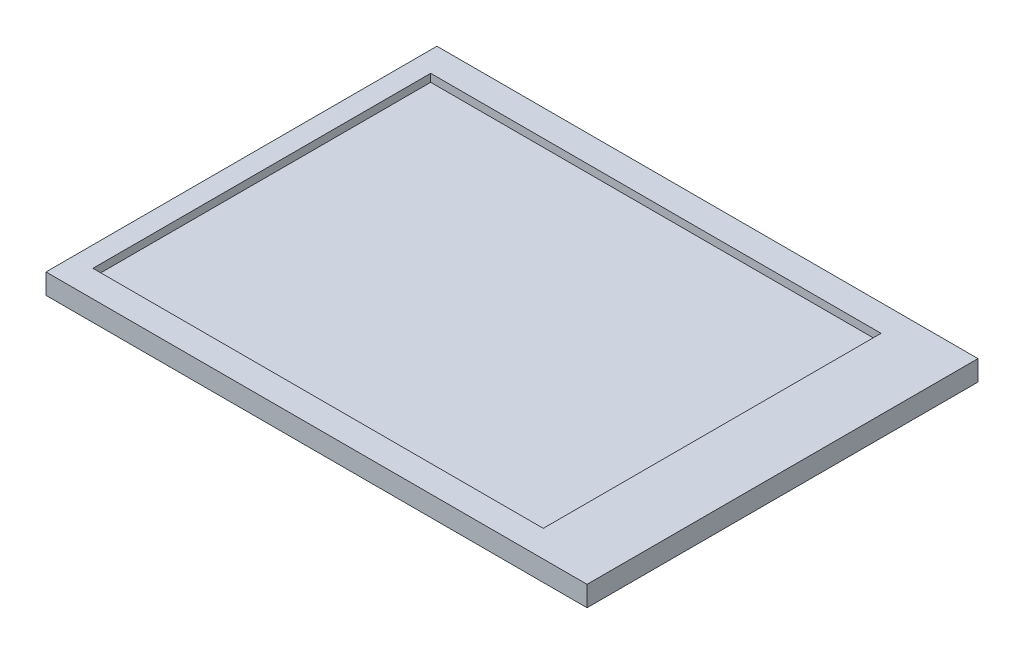
ISO-10303-21;
HEADER;
FILE_DESCRIPTION(('STEP AP214'),'2;1');
FILE_NAME('part.step','',(''),(''),'','','');
FILE_SCHEMA(('AUTOMOTIVE_DESIGN { 1 0 10303 214 1 1 1 1 }'));
ENDSEC;
DATA;
#1=APPLICATION_CONTEXT('core data for automotive mechanical design processes');
#2=APPLICATION_PROTOCOL_DEFINITION('international standard','automotive_design',2000,#1);
#3=PRODUCT_CONTEXT('',#1,'mechanical');
#4=PRODUCT('Part','Part','',(#3));
#5=PRODUCT_RELATED_PRODUCT_CATEGORY('part','',(#4));
#6=PRODUCT_DEFINITION_FORMATION('','',#4);
#7=PRODUCT_DEFINITION_CONTEXT('part definition',#1,'design');
#8=PRODUCT_DEFINITION('design','',#6,#7);
#9=PRODUCT_DEFINITION_SHAPE('','',#8);
#10=(LENGTH_UNIT() NAMED_UNIT(*) SI_UNIT(.MILLI.,.METRE.));
#11=(NAMED_UNIT(*) PLANE_ANGLE_UNIT() SI_UNIT($,.RADIAN.));
#12=(NAMED_UNIT(*) SI_UNIT($,.STERADIAN.) SOLID_ANGLE_UNIT());
#13=UNCERTAINTY_MEASURE_WITH_UNIT(LENGTH_MEASURE(1.E-05),#10,'distance_accuracy_value','');
#14=(GEOMETRIC_REPRESENTATION_CONTEXT(3) GLOBAL_UNCERTAINTY_ASSIGNED_CONTEXT((#13)) GLOBAL_UNIT_ASSIGNED_CONTEXT((#10,
#11,#12)) REPRESENTATION_CONTEXT('',''));
#15=CARTESIAN_POINT('',(0.,0.,0.));
#16=DIRECTION('',(0.,0.,1.));
#17=DIRECTION('',(1.,0.,0.));
#18=AXIS2_PLACEMENT_3D('',#15,#16,#17);
#19=CARTESIAN_POINT('',(0.,-2.6,25.));
#20=DIRECTION('',(0.,0.,1.));
#21=DIRECTION('',(1.,0.,0.));
#22=AXIS2_PLACEMENT_3D('',#19,#20,#21);
#23=PLANE('',#22);
#24=DIRECTION('',(1.,0.,0.));
#25=VECTOR('',#24,1.);
#26=CARTESIAN_POINT('',(0.,0.,25.));
#27=LINE('',#26,#25);
#28=CARTESIAN_POINT('',(-34.6,0.,25.));
#29=VERTEX_POINT('',#28);
#30=CARTESIAN_POINT('',(34.6,0.,25.));
#31=VERTEX_POINT('',#30);
#32=EDGE_CURVE('E143',#29,#31,#27,.T.);
#33=ORIENTED_EDGE('',*,*,#32,.F.);
#34=DIRECTION('',(0.,1.,0.));
#35=VECTOR('',#34,1.);
#36=CARTESIAN_POINT('',(-34.6,-2.6,25.));
#37=LINE('',#36,#35);
#38=CARTESIAN_POINT('',(-34.6,-2.6,25.));
#39=VERTEX_POINT('',#38);
#40=EDGE_CURVE('E11',#39,#29,#37,.T.);
#41=ORIENTED_EDGE('',*,*,#40,.F.);
#42=DIRECTION('',(1.,0.,0.));
#43=VECTOR('',#42,1.);
#44=CARTESIAN_POINT('',(0.,-2.6,25.));
#45=LINE('',#44,#43);
#46=CARTESIAN_POINT('',(34.6,-2.6,25.));
#47=VERTEX_POINT('',#46);
#48=EDGE_CURVE('E147',#39,#47,#45,.T.);
#49=ORIENTED_EDGE('',*,*,#48,.T.);
#50=DIRECTION('',(0.,1.,0.));
#51=VECTOR('',#50,1.);
#52=CARTESIAN_POINT('',(34.6,-2.6,25.));
#53=LINE('',#52,#51);
#54=EDGE_CURVE('E41',#47,#31,#53,.T.);
#55=ORIENTED_EDGE('',*,*,#54,.T.);
#56=EDGE_LOOP('',(#33,#41,#49,#55));
#57=FACE_BOUND('',#56,.T.);
#58=ADVANCED_FACE('F38',(#57),#23,.T.);
#59=CARTESIAN_POINT('',(-34.6,-2.6,0.));
#60=DIRECTION('',(1.,0.,0.));
#61=DIRECTION('',(0.,0.,-1.));
#62=AXIS2_PLACEMENT_3D('',#59,#60,#61);
#63=PLANE('',#62);
#64=DIRECTION('',(0.,0.,-1.));
#65=VECTOR('',#64,1.);
#66=CARTESIAN_POINT('',(-34.6,0.,0.));
#67=LINE('',#66,#65);
#68=CARTESIAN_POINT('',(-34.6,0.,-25.));
#69=VERTEX_POINT('',#68);
#70=EDGE_CURVE('E150',#29,#69,#67,.T.);
#71=ORIENTED_EDGE('',*,*,#70,.T.);
#72=DIRECTION('',(0.,1.,0.));
#73=VECTOR('',#72,1.);
#74=CARTESIAN_POINT('',(-34.6,-2.6,-25.));
#75=LINE('',#74,#73);
#76=CARTESIAN_POINT('',(-34.6,-2.6,-25.));
#77=VERTEX_POINT('',#76);
#78=EDGE_CURVE('E46',#77,#69,#75,.T.);
#79=ORIENTED_EDGE('',*,*,#78,.F.);
#80=DIRECTION('',(0.,0.,-1.));
#81=VECTOR('',#80,1.);
#82=CARTESIAN_POINT('',(-34.6,-2.6,0.));
#83=LINE('',#82,#81);
#84=EDGE_CURVE('E154',#39,#77,#83,.T.);
#85=ORIENTED_EDGE('',*,*,#84,.F.);
#86=ORIENTED_EDGE('',*,*,#40,.T.);
#87=EDGE_LOOP('',(#71,#79,#85,#86));
#88=FACE_BOUND('',#87,.T.);
#89=ADVANCED_FACE('F174',(#88),#63,.F.);
#90=CARTESIAN_POINT('',(0.,-2.6,-25.));
#91=DIRECTION('',(0.,0.,1.));
#92=DIRECTION('',(1.,0.,0.));
#93=AXIS2_PLACEMENT_3D('',#90,#91,#92);
#94=PLANE('',#93);
#95=DIRECTION('',(1.,0.,0.));
#96=VECTOR('',#95,1.);
#97=CARTESIAN_POINT('',(0.,0.,-25.));
#98=LINE('',#97,#96);
#99=CARTESIAN_POINT('',(34.6,0.,-25.));
#100=VERTEX_POINT('',#99);
#101=EDGE_CURVE('E161',#69,#100,#98,.T.);
#102=ORIENTED_EDGE('',*,*,#101,.T.);
#103=DIRECTION('',(0.,1.,0.));
#104=VECTOR('',#103,1.);
#105=CARTESIAN_POINT('',(34.6,-2.6,-25.));
#106=LINE('',#105,#104);
#107=CARTESIAN_POINT('',(34.6,-2.6,-25.));
#108=VERTEX_POINT('',#107);
#109=EDGE_CURVE('E166',#108,#100,#106,.T.);
#110=ORIENTED_EDGE('',*,*,#109,.F.);
#111=DIRECTION('',(1.,0.,0.));
#112=VECTOR('',#111,1.);
#113=CARTESIAN_POINT('',(0.,-2.6,-25.));
#114=LINE('',#113,#112);
#115=EDGE_CURVE('E152',#77,#108,#114,.T.);
#116=ORIENTED_EDGE('',*,*,#115,.F.);
#117=ORIENTED_EDGE('',*,*,#78,.T.);
#118=EDGE_LOOP('',(#102,#110,#116,#117));
#119=FACE_BOUND('',#118,.T.);
#120=ADVANCED_FACE('F177',(#119),#94,.F.);
#121=CARTESIAN_POINT('',(34.6,-2.6,0.));
#122=DIRECTION('',(1.,0.,0.));
#123=DIRECTION('',(0.,0.,-1.));
#124=AXIS2_PLACEMENT_3D('',#121,#122,#123);
#125=PLANE('',#124);
#126=DIRECTION('',(0.,0.,-1.));
#127=VECTOR('',#126,1.);
#128=CARTESIAN_POINT('',(34.6,0.,0.));
#129=LINE('',#128,#127);
#130=EDGE_CURVE('E158',#31,#100,#129,.T.);
#131=ORIENTED_EDGE('',*,*,#130,.F.);
#132=ORIENTED_EDGE('',*,*,#54,.F.);
#133=DIRECTION('',(0.,0.,-1.));
#134=VECTOR('',#133,1.);
#135=CARTESIAN_POINT('',(34.6,-2.6,0.));
#136=LINE('',#135,#134);
#137=EDGE_CURVE('E149',#47,#108,#136,.T.);
#138=ORIENTED_EDGE('',*,*,#137,.T.);
#139=ORIENTED_EDGE('',*,*,#109,.T.);
#140=EDGE_LOOP('',(#131,#132,#138,#139));
#141=FACE_BOUND('',#140,.T.);
#142=ADVANCED_FACE('F169',(#141),#125,.T.);
#143=CARTESIAN_POINT('',(0.,-2.6,0.));
#144=DIRECTION('',(0.,1.,0.));
#145=DIRECTION('',(0.,0.,1.));
#146=AXIS2_PLACEMENT_3D('',#143,#144,#145);
#147=PLANE('',#146);
#148=ORIENTED_EDGE('',*,*,#48,.F.);
#149=ORIENTED_EDGE('',*,*,#84,.T.);
#150=ORIENTED_EDGE('',*,*,#115,.T.);
#151=ORIENTED_EDGE('',*,*,#137,.F.);
#152=EDGE_LOOP('',(#148,#149,#150,#151));
#153=FACE_BOUND('',#152,.T.);
#154=ADVANCED_FACE('F179',(#153),#147,.F.);
#155=CARTESIAN_POINT('',(0.,0.,0.));
#156=DIRECTION('',(0.,1.,0.));
#157=DIRECTION('',(0.,0.,1.));
#158=AXIS2_PLACEMENT_3D('',#155,#156,#157);
#159=PLANE('',#158);
#160=DIRECTION('',(1.,0.,0.));
#161=VECTOR('',#160,1.);
#162=CARTESIAN_POINT('',(0.,0.,21.6));
#163=LINE('',#162,#161);
#164=CARTESIAN_POINT('',(-32.,0.,21.6));
#165=VERTEX_POINT('',#164);
#166=CARTESIAN_POINT('',(25.6,0.,21.6));
#167=VERTEX_POINT('',#166);
#168=EDGE_CURVE('E54',#165,#167,#163,.T.);
#169=ORIENTED_EDGE('',*,*,#168,.F.);
#170=DIRECTION('',(0.,0.,-1.));
#171=VECTOR('',#170,1.);
#172=CARTESIAN_POINT('',(-32.,0.,0.));
#173=LINE('',#172,#171);
#174=CARTESIAN_POINT('',(-32.,0.,-21.6));
#175=VERTEX_POINT('',#174);
#176=EDGE_CURVE('E128',#165,#175,#173,.T.);
#177=ORIENTED_EDGE('',*,*,#176,.T.);
#178=DIRECTION('',(1.,0.,0.));
#179=VECTOR('',#178,1.);
#180=CARTESIAN_POINT('',(0.,0.,-21.6));
#181=LINE('',#180,#179);
#182=CARTESIAN_POINT('',(25.6,0.,-21.6));
#183=VERTEX_POINT('',#182);
#184=EDGE_CURVE('E131',#175,#183,#181,.T.);
#185=ORIENTED_EDGE('',*,*,#184,.T.);
#186=DIRECTION('',(0.,0.,-1.));
#187=VECTOR('',#186,1.);
#188=CARTESIAN_POINT('',(25.6,0.,0.));
#189=LINE('',#188,#187);
#190=EDGE_CURVE('E137',#167,#183,#189,.T.);
#191=ORIENTED_EDGE('',*,*,#190,.F.);
#192=EDGE_LOOP('',(#169,#177,#185,#191));
#193=FACE_BOUND('',#192,.T.);
#194=ORIENTED_EDGE('',*,*,#32,.T.);
#195=ORIENTED_EDGE('',*,*,#130,.T.);
#196=ORIENTED_EDGE('',*,*,#101,.F.);
#197=ORIENTED_EDGE('',*,*,#70,.F.);
#198=EDGE_LOOP('',(#194,#195,#196,#197));
#199=FACE_BOUND('',#198,.T.);
#200=ADVANCED_FACE('F172',(#193,#199),#159,.T.);
#201=CARTESIAN_POINT('',(0.,-1.,21.6));
#202=DIRECTION('',(0.,0.,1.));
#203=DIRECTION('',(1.,0.,0.));
#204=AXIS2_PLACEMENT_3D('',#201,#202,#203);
#205=PLANE('',#204);
#206=ORIENTED_EDGE('',*,*,#168,.T.);
#207=DIRECTION('',(0.,1.,0.));
#208=VECTOR('',#207,1.);
#209=CARTESIAN_POINT('',(25.6,-1.,21.6));
#210=LINE('',#209,#208);
#211=CARTESIAN_POINT('',(25.6,-1.,21.6));
#212=VERTEX_POINT('',#211);
#213=EDGE_CURVE('E107',#212,#167,#210,.T.);
#214=ORIENTED_EDGE('',*,*,#213,.F.);
#215=DIRECTION('',(1.,0.,0.));
#216=VECTOR('',#215,1.);
#217=CARTESIAN_POINT('',(0.,-1.,21.6));
#218=LINE('',#217,#216);
#219=CARTESIAN_POINT('',(-32.,-1.,21.6));
#220=VERTEX_POINT('',#219);
#221=EDGE_CURVE('E111',#220,#212,#218,.T.);
#222=ORIENTED_EDGE('',*,*,#221,.F.);
#223=DIRECTION('',(0.,1.,0.));
#224=VECTOR('',#223,1.);
#225=CARTESIAN_POINT('',(-32.,-1.,21.6));
#226=LINE('',#225,#224);
#227=EDGE_CURVE('E141',#220,#165,#226,.T.);
#228=ORIENTED_EDGE('',*,*,#227,.T.);
#229=EDGE_LOOP('',(#206,#214,#222,#228));
#230=FACE_BOUND('',#229,.T.);
#231=ADVANCED_FACE('F109',(#230),#205,.F.);
#232=CARTESIAN_POINT('',(-32.,-1.,0.));
#233=DIRECTION('',(1.,0.,0.));
#234=DIRECTION('',(0.,0.,-1.));
#235=AXIS2_PLACEMENT_3D('',#232,#233,#234);
#236=PLANE('',#235);
#237=ORIENTED_EDGE('',*,*,#176,.F.);
#238=ORIENTED_EDGE('',*,*,#227,.F.);
#239=DIRECTION('',(0.,0.,-1.));
#240=VECTOR('',#239,1.);
#241=CARTESIAN_POINT('',(-32.,-1.,0.));
#242=LINE('',#241,#240);
#243=CARTESIAN_POINT('',(-32.,-1.,-21.6));
#244=VERTEX_POINT('',#243);
#245=EDGE_CURVE('E116',#220,#244,#242,.T.);
#246=ORIENTED_EDGE('',*,*,#245,.T.);
#247=DIRECTION('',(0.,1.,0.));
#248=VECTOR('',#247,1.);
#249=CARTESIAN_POINT('',(-32.,-1.,-21.6));
#250=LINE('',#249,#248);
#251=EDGE_CURVE('E144',#244,#175,#250,.T.);
#252=ORIENTED_EDGE('',*,*,#251,.T.);
#253=EDGE_LOOP('',(#237,#238,#246,#252));
#254=FACE_BOUND('',#253,.T.);
#255=ADVANCED_FACE('F223',(#254),#236,.T.);
#256=CARTESIAN_POINT('',(0.,-1.,-21.6));
#257=DIRECTION('',(0.,0.,1.));
#258=DIRECTION('',(1.,0.,0.));
#259=AXIS2_PLACEMENT_3D('',#256,#257,#258);
#260=PLANE('',#259);
#261=ORIENTED_EDGE('',*,*,#184,.F.);
#262=ORIENTED_EDGE('',*,*,#251,.F.);
#263=DIRECTION('',(1.,0.,0.));
#264=VECTOR('',#263,1.);
#265=CARTESIAN_POINT('',(0.,-1.,-21.6));
#266=LINE('',#265,#264);
#267=CARTESIAN_POINT('',(25.6,-1.,-21.6));
#268=VERTEX_POINT('',#267);
#269=EDGE_CURVE('E124',#244,#268,#266,.T.);
#270=ORIENTED_EDGE('',*,*,#269,.T.);
#271=DIRECTION('',(0.,1.,0.));
#272=VECTOR('',#271,1.);
#273=CARTESIAN_POINT('',(25.6,-1.,-21.6));
#274=LINE('',#273,#272);
#275=EDGE_CURVE('E115',#268,#183,#274,.T.);
#276=ORIENTED_EDGE('',*,*,#275,.T.);
#277=EDGE_LOOP('',(#261,#262,#270,#276));
#278=FACE_BOUND('',#277,.T.);
#279=ADVANCED_FACE('F231',(#278),#260,.T.);
#280=CARTESIAN_POINT('',(25.6,-1.,0.));
#281=DIRECTION('',(1.,0.,0.));
#282=DIRECTION('',(0.,0.,-1.));
#283=AXIS2_PLACEMENT_3D('',#280,#281,#282);
#284=PLANE('',#283);
#285=ORIENTED_EDGE('',*,*,#190,.T.);
#286=ORIENTED_EDGE('',*,*,#275,.F.);
#287=DIRECTION('',(0.,0.,-1.));
#288=VECTOR('',#287,1.);
#289=CARTESIAN_POINT('',(25.6,-1.,0.));
#290=LINE('',#289,#288);
#291=EDGE_CURVE('E120',#212,#268,#290,.T.);
#292=ORIENTED_EDGE('',*,*,#291,.F.);
#293=ORIENTED_EDGE('',*,*,#213,.T.);
#294=EDGE_LOOP('',(#285,#286,#292,#293));
#295=FACE_BOUND('',#294,.T.);
#296=ADVANCED_FACE('F121',(#295),#284,.F.);
#297=CARTESIAN_POINT('',(0.,-1.,0.));
#298=DIRECTION('',(0.,1.,0.));
#299=DIRECTION('',(0.,0.,1.));
#300=AXIS2_PLACEMENT_3D('',#297,#298,#299);
#301=PLANE('',#300);
#302=ORIENTED_EDGE('',*,*,#221,.T.);
#303=ORIENTED_EDGE('',*,*,#291,.T.);
#304=ORIENTED_EDGE('',*,*,#269,.F.);
#305=ORIENTED_EDGE('',*,*,#245,.F.);
#306=EDGE_LOOP('',(#302,#303,#304,#305));
#307=FACE_BOUND('',#306,.T.);
#308=ADVANCED_FACE('F127',(#307),#301,.T.);
#309=CLOSED_SHELL('',(#58,#89,#120,#142,#154,#200,#231,#255,#279,#296,#308));
#310=MANIFOLD_SOLID_BREP('B2',#309);
#311=ADVANCED_BREP_SHAPE_REPRESENTATION('',(#18,#310),#14);
#312=SHAPE_DEFINITION_REPRESENTATION(#9,#311);
ENDSEC;
END-ISO-10303-21;
